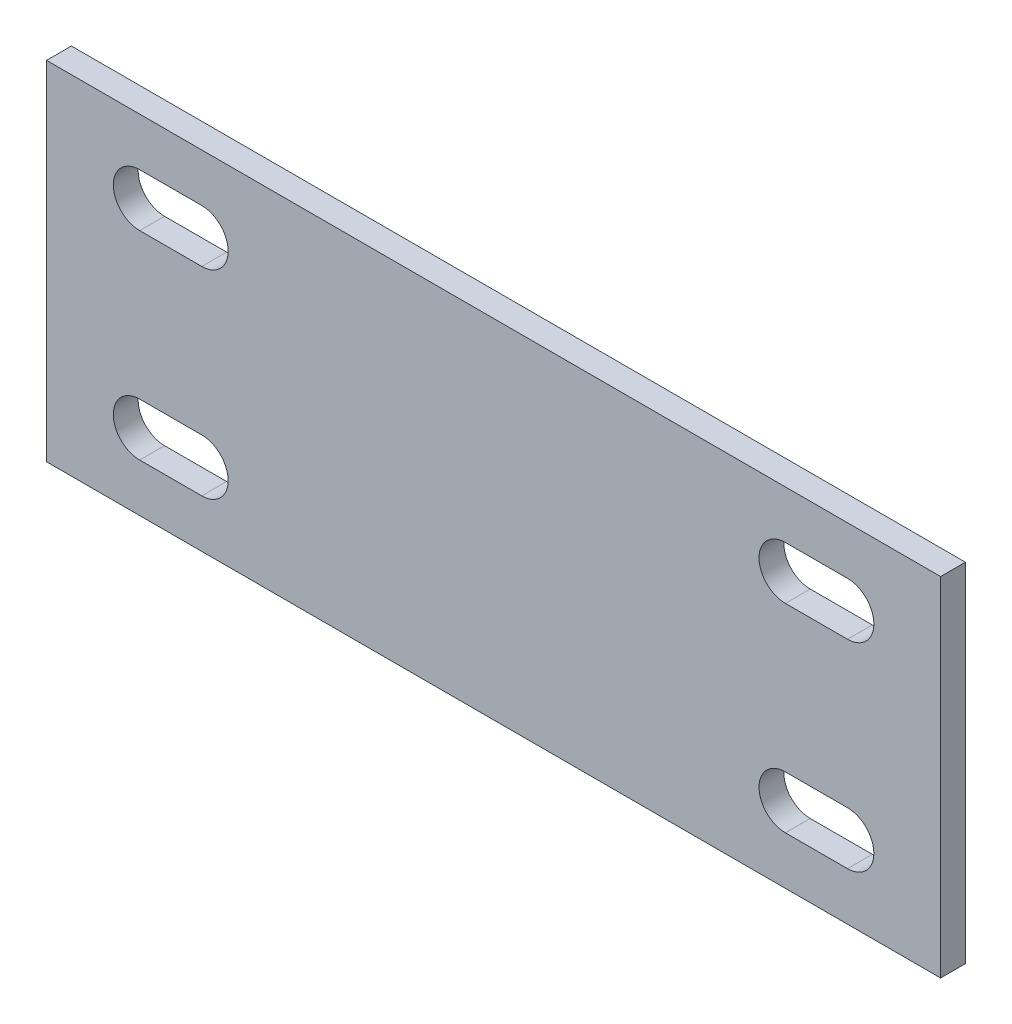
ISO-10303-21;
HEADER;
FILE_DESCRIPTION(('STEP AP214'),'2;1');
FILE_NAME('part.step','',(''),(''),'','','');
FILE_SCHEMA(('AUTOMOTIVE_DESIGN { 1 0 10303 214 1 1 1 1 }'));
ENDSEC;
DATA;
#1=APPLICATION_CONTEXT('core data for automotive mechanical design processes');
#2=APPLICATION_PROTOCOL_DEFINITION('international standard','automotive_design',2000,#1);
#3=PRODUCT_CONTEXT('',#1,'mechanical');
#4=PRODUCT('Part','Part','',(#3));
#5=PRODUCT_RELATED_PRODUCT_CATEGORY('part','',(#4));
#6=PRODUCT_DEFINITION_FORMATION('','',#4);
#7=PRODUCT_DEFINITION_CONTEXT('part definition',#1,'design');
#8=PRODUCT_DEFINITION('design','',#6,#7);
#9=PRODUCT_DEFINITION_SHAPE('','',#8);
#10=(LENGTH_UNIT() NAMED_UNIT(*) SI_UNIT(.MILLI.,.METRE.));
#11=(NAMED_UNIT(*) PLANE_ANGLE_UNIT() SI_UNIT($,.RADIAN.));
#12=(NAMED_UNIT(*) SI_UNIT($,.STERADIAN.) SOLID_ANGLE_UNIT());
#13=UNCERTAINTY_MEASURE_WITH_UNIT(LENGTH_MEASURE(1.E-05),#10,'distance_accuracy_value','');
#14=(GEOMETRIC_REPRESENTATION_CONTEXT(3) GLOBAL_UNCERTAINTY_ASSIGNED_CONTEXT((#13)) GLOBAL_UNIT_ASSIGNED_CONTEXT((#10,
#11,#12)) REPRESENTATION_CONTEXT('',''));
#15=CARTESIAN_POINT('',(0.,0.,0.));
#16=DIRECTION('',(0.,0.,1.));
#17=DIRECTION('',(1.,0.,0.));
#18=AXIS2_PLACEMENT_3D('',#15,#16,#17);
#19=CARTESIAN_POINT('',(0.,0.,6.35));
#20=DIRECTION('',(1.,0.,0.));
#21=DIRECTION('',(0.,1.,0.));
#22=AXIS2_PLACEMENT_3D('',#19,#20,#21);
#23=PLANE('',#22);
#24=DIRECTION('',(0.,-1.,0.));
#25=VECTOR('',#24,1.);
#26=CARTESIAN_POINT('',(0.,0.,0.));
#27=LINE('',#26,#25);
#28=CARTESIAN_POINT('',(0.,88.9,0.));
#29=VERTEX_POINT('',#28);
#30=CARTESIAN_POINT('',(0.,0.,0.));
#31=VERTEX_POINT('',#30);
#32=EDGE_CURVE('E297',#29,#31,#27,.T.);
#33=ORIENTED_EDGE('',*,*,#32,.T.);
#34=DIRECTION('',(0.,0.,-1.));
#35=VECTOR('',#34,1.);
#36=CARTESIAN_POINT('',(0.,0.,6.35));
#37=LINE('',#36,#35);
#38=CARTESIAN_POINT('',(0.,0.,6.35));
#39=VERTEX_POINT('',#38);
#40=EDGE_CURVE('E11',#39,#31,#37,.T.);
#41=ORIENTED_EDGE('',*,*,#40,.F.);
#42=DIRECTION('',(0.,-1.,0.));
#43=VECTOR('',#42,1.);
#44=CARTESIAN_POINT('',(0.,0.,6.35));
#45=LINE('',#44,#43);
#46=CARTESIAN_POINT('',(0.,88.9,6.35));
#47=VERTEX_POINT('',#46);
#48=EDGE_CURVE('E304',#47,#39,#45,.T.);
#49=ORIENTED_EDGE('',*,*,#48,.F.);
#50=DIRECTION('',(0.,0.,-1.));
#51=VECTOR('',#50,1.);
#52=CARTESIAN_POINT('',(0.,88.9,6.35));
#53=LINE('',#52,#51);
#54=EDGE_CURVE('E314',#47,#29,#53,.T.);
#55=ORIENTED_EDGE('',*,*,#54,.T.);
#56=EDGE_LOOP('',(#33,#41,#49,#55));
#57=FACE_BOUND('',#56,.T.);
#58=ADVANCED_FACE('F35',(#57),#23,.F.);
#59=CARTESIAN_POINT('',(0.,0.,6.35));
#60=DIRECTION('',(0.,1.,0.));
#61=DIRECTION('',(0.,0.,1.));
#62=AXIS2_PLACEMENT_3D('',#59,#60,#61);
#63=PLANE('',#62);
#64=DIRECTION('',(1.,0.,0.));
#65=VECTOR('',#64,1.);
#66=CARTESIAN_POINT('',(0.,0.,0.));
#67=LINE('',#66,#65);
#68=CARTESIAN_POINT('',(228.6,0.,0.));
#69=VERTEX_POINT('',#68);
#70=EDGE_CURVE('E317',#31,#69,#67,.T.);
#71=ORIENTED_EDGE('',*,*,#70,.T.);
#72=DIRECTION('',(0.,0.,-1.));
#73=VECTOR('',#72,1.);
#74=CARTESIAN_POINT('',(228.6,0.,6.35));
#75=LINE('',#74,#73);
#76=CARTESIAN_POINT('',(228.6,0.,6.35));
#77=VERTEX_POINT('',#76);
#78=EDGE_CURVE('E42',#77,#69,#75,.T.);
#79=ORIENTED_EDGE('',*,*,#78,.F.);
#80=DIRECTION('',(1.,0.,0.));
#81=VECTOR('',#80,1.);
#82=CARTESIAN_POINT('',(0.,0.,6.35));
#83=LINE('',#82,#81);
#84=EDGE_CURVE('E307',#39,#77,#83,.T.);
#85=ORIENTED_EDGE('',*,*,#84,.F.);
#86=ORIENTED_EDGE('',*,*,#40,.T.);
#87=EDGE_LOOP('',(#71,#79,#85,#86));
#88=FACE_BOUND('',#87,.T.);
#89=ADVANCED_FACE('F346',(#88),#63,.F.);
#90=CARTESIAN_POINT('',(228.6,0.,6.35));
#91=DIRECTION('',(-1.,0.,0.));
#92=DIRECTION('',(0.,0.,1.));
#93=AXIS2_PLACEMENT_3D('',#90,#91,#92);
#94=PLANE('',#93);
#95=DIRECTION('',(0.,1.,0.));
#96=VECTOR('',#95,1.);
#97=CARTESIAN_POINT('',(228.6,0.,0.));
#98=LINE('',#97,#96);
#99=CARTESIAN_POINT('',(228.6,88.9,0.));
#100=VERTEX_POINT('',#99);
#101=EDGE_CURVE('E319',#69,#100,#98,.T.);
#102=ORIENTED_EDGE('',*,*,#101,.T.);
#103=DIRECTION('',(0.,0.,-1.));
#104=VECTOR('',#103,1.);
#105=CARTESIAN_POINT('',(228.6,88.9,6.35));
#106=LINE('',#105,#104);
#107=CARTESIAN_POINT('',(228.6,88.9,6.35));
#108=VERTEX_POINT('',#107);
#109=EDGE_CURVE('E324',#108,#100,#106,.T.);
#110=ORIENTED_EDGE('',*,*,#109,.F.);
#111=DIRECTION('',(0.,1.,0.));
#112=VECTOR('',#111,1.);
#113=CARTESIAN_POINT('',(228.6,0.,6.35));
#114=LINE('',#113,#112);
#115=EDGE_CURVE('E310',#77,#108,#114,.T.);
#116=ORIENTED_EDGE('',*,*,#115,.F.);
#117=ORIENTED_EDGE('',*,*,#78,.T.);
#118=EDGE_LOOP('',(#102,#110,#116,#117));
#119=FACE_BOUND('',#118,.T.);
#120=ADVANCED_FACE('F331',(#119),#94,.F.);
#121=CARTESIAN_POINT('',(0.,88.9,6.35));
#122=DIRECTION('',(0.,-1.,0.));
#123=DIRECTION('',(0.,0.,-1.));
#124=AXIS2_PLACEMENT_3D('',#121,#122,#123);
#125=PLANE('',#124);
#126=DIRECTION('',(-1.,0.,0.));
#127=VECTOR('',#126,1.);
#128=CARTESIAN_POINT('',(0.,88.9,0.));
#129=LINE('',#128,#127);
#130=EDGE_CURVE('E308',#100,#29,#129,.T.);
#131=ORIENTED_EDGE('',*,*,#130,.T.);
#132=ORIENTED_EDGE('',*,*,#54,.F.);
#133=DIRECTION('',(-1.,0.,0.));
#134=VECTOR('',#133,1.);
#135=CARTESIAN_POINT('',(0.,88.9,6.35));
#136=LINE('',#135,#134);
#137=EDGE_CURVE('E312',#108,#47,#136,.T.);
#138=ORIENTED_EDGE('',*,*,#137,.F.);
#139=ORIENTED_EDGE('',*,*,#109,.T.);
#140=EDGE_LOOP('',(#131,#132,#138,#139));
#141=FACE_BOUND('',#140,.T.);
#142=ADVANCED_FACE('F339',(#141),#125,.F.);
#143=CARTESIAN_POINT('',(0.,88.9,6.35));
#144=DIRECTION('',(0.,0.,-1.));
#145=DIRECTION('',(-1.,0.,0.));
#146=AXIS2_PLACEMENT_3D('',#143,#144,#145);
#147=PLANE('',#146);
#148=DIRECTION('',(1.,0.,0.));
#149=VECTOR('',#148,1.);
#150=CARTESIAN_POINT('',(188.9125,12.3063,6.35));
#151=LINE('',#150,#149);
#152=CARTESIAN_POINT('',(188.9125,12.3063,6.35));
#153=VERTEX_POINT('',#152);
#154=CARTESIAN_POINT('',(204.7875,12.3063,6.35));
#155=VERTEX_POINT('',#154);
#156=EDGE_CURVE('E198',#153,#155,#151,.T.);
#157=ORIENTED_EDGE('',*,*,#156,.F.);
#158=CARTESIAN_POINT('',(188.9125,19.05,6.35));
#159=DIRECTION('',(0.,0.,1.));
#160=DIRECTION('',(1.,0.,0.));
#161=AXIS2_PLACEMENT_3D('',#158,#159,#160);
#162=CIRCLE('',#161,6.7437);
#163=CARTESIAN_POINT('',(188.9125,25.7937,6.35));
#164=VERTEX_POINT('',#163);
#165=EDGE_CURVE('E49',#164,#153,#162,.T.);
#166=ORIENTED_EDGE('',*,*,#165,.F.);
#167=DIRECTION('',(-1.,0.,0.));
#168=VECTOR('',#167,1.);
#169=CARTESIAN_POINT('',(188.9125,25.7937,6.35));
#170=LINE('',#169,#168);
#171=CARTESIAN_POINT('',(204.7875,25.7937,6.35));
#172=VERTEX_POINT('',#171);
#173=EDGE_CURVE('E189',#172,#164,#170,.T.);
#174=ORIENTED_EDGE('',*,*,#173,.F.);
#175=CARTESIAN_POINT('',(204.7875,19.05,6.35));
#176=DIRECTION('',(0.,0.,1.));
#177=DIRECTION('',(1.,0.,0.));
#178=AXIS2_PLACEMENT_3D('',#175,#176,#177);
#179=CIRCLE('',#178,6.7437);
#180=EDGE_CURVE('E192',#155,#172,#179,.T.);
#181=ORIENTED_EDGE('',*,*,#180,.F.);
#182=EDGE_LOOP('',(#157,#166,#174,#181));
#183=FACE_BOUND('',#182,.T.);
#184=DIRECTION('',(1.,0.,0.));
#185=VECTOR('',#184,1.);
#186=CARTESIAN_POINT('',(188.9125,63.1063,6.35));
#187=LINE('',#186,#185);
#188=CARTESIAN_POINT('',(188.9125,63.1063,6.35));
#189=VERTEX_POINT('',#188);
#190=CARTESIAN_POINT('',(204.7875,63.1063,6.35));
#191=VERTEX_POINT('',#190);
#192=EDGE_CURVE('E223',#189,#191,#187,.T.);
#193=ORIENTED_EDGE('',*,*,#192,.F.);
#194=CARTESIAN_POINT('',(188.9125,69.85,6.35));
#195=DIRECTION('',(0.,0.,1.));
#196=DIRECTION('',(1.,0.,0.));
#197=AXIS2_PLACEMENT_3D('',#194,#195,#196);
#198=CIRCLE('',#197,6.74369999999999);
#199=CARTESIAN_POINT('',(188.9125,76.5937,6.35));
#200=VERTEX_POINT('',#199);
#201=EDGE_CURVE('E204',#200,#189,#198,.T.);
#202=ORIENTED_EDGE('',*,*,#201,.F.);
#203=DIRECTION('',(-1.,0.,0.));
#204=VECTOR('',#203,1.);
#205=CARTESIAN_POINT('',(188.9125,76.5937,6.35));
#206=LINE('',#205,#204);
#207=CARTESIAN_POINT('',(204.7875,76.5937,6.35));
#208=VERTEX_POINT('',#207);
#209=EDGE_CURVE('E212',#208,#200,#206,.T.);
#210=ORIENTED_EDGE('',*,*,#209,.F.);
#211=CARTESIAN_POINT('',(204.7875,69.85,6.35));
#212=DIRECTION('',(0.,0.,1.));
#213=DIRECTION('',(1.,0.,0.));
#214=AXIS2_PLACEMENT_3D('',#211,#212,#213);
#215=CIRCLE('',#214,6.74369999999999);
#216=EDGE_CURVE('E226',#191,#208,#215,.T.);
#217=ORIENTED_EDGE('',*,*,#216,.F.);
#218=EDGE_LOOP('',(#193,#202,#210,#217));
#219=FACE_BOUND('',#218,.T.);
#220=DIRECTION('',(1.,0.,0.));
#221=VECTOR('',#220,1.);
#222=CARTESIAN_POINT('',(23.8125,12.3063,6.35));
#223=LINE('',#222,#221);
#224=CARTESIAN_POINT('',(23.8125,12.3063,6.35));
#225=VERTEX_POINT('',#224);
#226=CARTESIAN_POINT('',(39.6875,12.3063,6.35));
#227=VERTEX_POINT('',#226);
#228=EDGE_CURVE('E255',#225,#227,#223,.T.);
#229=ORIENTED_EDGE('',*,*,#228,.F.);
#230=CARTESIAN_POINT('',(23.8125,19.05,6.35));
#231=DIRECTION('',(0.,0.,1.));
#232=DIRECTION('',(1.,0.,0.));
#233=AXIS2_PLACEMENT_3D('',#230,#231,#232);
#234=CIRCLE('',#233,6.7437);
#235=CARTESIAN_POINT('',(23.8125,25.7937,6.35));
#236=VERTEX_POINT('',#235);
#237=EDGE_CURVE('E233',#236,#225,#234,.T.);
#238=ORIENTED_EDGE('',*,*,#237,.F.);
#239=DIRECTION('',(-1.,0.,0.));
#240=VECTOR('',#239,1.);
#241=CARTESIAN_POINT('',(23.8125,25.7937,6.35));
#242=LINE('',#241,#240);
#243=CARTESIAN_POINT('',(39.6875,25.7937,6.35));
#244=VERTEX_POINT('',#243);
#245=EDGE_CURVE('E244',#244,#236,#242,.T.);
#246=ORIENTED_EDGE('',*,*,#245,.F.);
#247=CARTESIAN_POINT('',(39.6875,19.05,6.35));
#248=DIRECTION('',(0.,0.,1.));
#249=DIRECTION('',(1.,0.,0.));
#250=AXIS2_PLACEMENT_3D('',#247,#248,#249);
#251=CIRCLE('',#250,6.7437);
#252=EDGE_CURVE('E258',#227,#244,#251,.T.);
#253=ORIENTED_EDGE('',*,*,#252,.F.);
#254=EDGE_LOOP('',(#229,#238,#246,#253));
#255=FACE_BOUND('',#254,.T.);
#256=DIRECTION('',(1.,0.,0.));
#257=VECTOR('',#256,1.);
#258=CARTESIAN_POINT('',(23.8125,63.1063,6.35));
#259=LINE('',#258,#257);
#260=CARTESIAN_POINT('',(23.8125,63.1063,6.35));
#261=VERTEX_POINT('',#260);
#262=CARTESIAN_POINT('',(39.6875,63.1063,6.35));
#263=VERTEX_POINT('',#262);
#264=EDGE_CURVE('E287',#261,#263,#259,.T.);
#265=ORIENTED_EDGE('',*,*,#264,.F.);
#266=CARTESIAN_POINT('',(23.8125,69.85,6.35));
#267=DIRECTION('',(0.,0.,1.));
#268=DIRECTION('',(1.,0.,0.));
#269=AXIS2_PLACEMENT_3D('',#266,#267,#268);
#270=CIRCLE('',#269,6.74369999999999);
#271=CARTESIAN_POINT('',(23.8125,76.5937,6.35));
#272=VERTEX_POINT('',#271);
#273=EDGE_CURVE('E265',#272,#261,#270,.T.);
#274=ORIENTED_EDGE('',*,*,#273,.F.);
#275=DIRECTION('',(-1.,0.,0.));
#276=VECTOR('',#275,1.);
#277=CARTESIAN_POINT('',(23.8125,76.5937,6.35));
#278=LINE('',#277,#276);
#279=CARTESIAN_POINT('',(39.6875,76.5937,6.35));
#280=VERTEX_POINT('',#279);
#281=EDGE_CURVE('E276',#280,#272,#278,.T.);
#282=ORIENTED_EDGE('',*,*,#281,.F.);
#283=CARTESIAN_POINT('',(39.6875,69.85,6.35));
#284=DIRECTION('',(0.,0.,1.));
#285=DIRECTION('',(1.,0.,0.));
#286=AXIS2_PLACEMENT_3D('',#283,#284,#285);
#287=CIRCLE('',#286,6.74369999999999);
#288=EDGE_CURVE('E290',#263,#280,#287,.T.);
#289=ORIENTED_EDGE('',*,*,#288,.F.);
#290=EDGE_LOOP('',(#265,#274,#282,#289));
#291=FACE_BOUND('',#290,.T.);
#292=ORIENTED_EDGE('',*,*,#48,.T.);
#293=ORIENTED_EDGE('',*,*,#84,.T.);
#294=ORIENTED_EDGE('',*,*,#115,.T.);
#295=ORIENTED_EDGE('',*,*,#137,.T.);
#296=EDGE_LOOP('',(#292,#293,#294,#295));
#297=FACE_BOUND('',#296,.T.);
#298=ADVANCED_FACE('F345',(#183,#219,#255,#291,#297),#147,.F.);
#299=CARTESIAN_POINT('',(0.,88.9,0.));
#300=DIRECTION('',(0.,0.,-1.));
#301=DIRECTION('',(-1.,0.,0.));
#302=AXIS2_PLACEMENT_3D('',#299,#300,#301);
#303=PLANE('',#302);
#304=CARTESIAN_POINT('',(188.9125,19.05,0.));
#305=DIRECTION('',(0.,0.,1.));
#306=DIRECTION('',(1.,0.,0.));
#307=AXIS2_PLACEMENT_3D('',#304,#305,#306);
#308=CIRCLE('',#307,6.7437);
#309=CARTESIAN_POINT('',(188.9125,25.7937,0.));
#310=VERTEX_POINT('',#309);
#311=CARTESIAN_POINT('',(188.9125,12.3063,0.));
#312=VERTEX_POINT('',#311);
#313=EDGE_CURVE('E173',#310,#312,#308,.T.);
#314=ORIENTED_EDGE('',*,*,#313,.T.);
#315=DIRECTION('',(1.,0.,0.));
#316=VECTOR('',#315,1.);
#317=CARTESIAN_POINT('',(188.9125,12.3063,0.));
#318=LINE('',#317,#316);
#319=CARTESIAN_POINT('',(204.7875,12.3063,0.));
#320=VERTEX_POINT('',#319);
#321=EDGE_CURVE('E182',#312,#320,#318,.T.);
#322=ORIENTED_EDGE('',*,*,#321,.T.);
#323=CARTESIAN_POINT('',(204.7875,19.05,0.));
#324=DIRECTION('',(0.,0.,1.));
#325=DIRECTION('',(1.,0.,0.));
#326=AXIS2_PLACEMENT_3D('',#323,#324,#325);
#327=CIRCLE('',#326,6.7437);
#328=CARTESIAN_POINT('',(204.7875,25.7937,0.));
#329=VERTEX_POINT('',#328);
#330=EDGE_CURVE('E57',#320,#329,#327,.T.);
#331=ORIENTED_EDGE('',*,*,#330,.T.);
#332=DIRECTION('',(-1.,0.,0.));
#333=VECTOR('',#332,1.);
#334=CARTESIAN_POINT('',(188.9125,25.7937,0.));
#335=LINE('',#334,#333);
#336=EDGE_CURVE('E179',#329,#310,#335,.T.);
#337=ORIENTED_EDGE('',*,*,#336,.T.);
#338=EDGE_LOOP('',(#314,#322,#331,#337));
#339=FACE_BOUND('',#338,.T.);
#340=CARTESIAN_POINT('',(188.9125,69.85,0.));
#341=DIRECTION('',(0.,0.,1.));
#342=DIRECTION('',(1.,0.,0.));
#343=AXIS2_PLACEMENT_3D('',#340,#341,#342);
#344=CIRCLE('',#343,6.74369999999999);
#345=CARTESIAN_POINT('',(188.9125,76.5937,0.));
#346=VERTEX_POINT('',#345);
#347=CARTESIAN_POINT('',(188.9125,63.1063,0.));
#348=VERTEX_POINT('',#347);
#349=EDGE_CURVE('E208',#346,#348,#344,.T.);
#350=ORIENTED_EDGE('',*,*,#349,.T.);
#351=DIRECTION('',(1.,0.,0.));
#352=VECTOR('',#351,1.);
#353=CARTESIAN_POINT('',(188.9125,63.1063,0.));
#354=LINE('',#353,#352);
#355=CARTESIAN_POINT('',(204.7875,63.1063,0.));
#356=VERTEX_POINT('',#355);
#357=EDGE_CURVE('E211',#348,#356,#354,.T.);
#358=ORIENTED_EDGE('',*,*,#357,.T.);
#359=CARTESIAN_POINT('',(204.7875,69.85,0.));
#360=DIRECTION('',(0.,0.,1.));
#361=DIRECTION('',(1.,0.,0.));
#362=AXIS2_PLACEMENT_3D('',#359,#360,#361);
#363=CIRCLE('',#362,6.74369999999999);
#364=CARTESIAN_POINT('',(204.7875,76.5937,0.));
#365=VERTEX_POINT('',#364);
#366=EDGE_CURVE('E215',#356,#365,#363,.T.);
#367=ORIENTED_EDGE('',*,*,#366,.T.);
#368=DIRECTION('',(-1.,0.,0.));
#369=VECTOR('',#368,1.);
#370=CARTESIAN_POINT('',(188.9125,76.5937,0.));
#371=LINE('',#370,#369);
#372=EDGE_CURVE('E218',#365,#346,#371,.T.);
#373=ORIENTED_EDGE('',*,*,#372,.T.);
#374=EDGE_LOOP('',(#350,#358,#367,#373));
#375=FACE_BOUND('',#374,.T.);
#376=CARTESIAN_POINT('',(23.8125,19.05,0.));
#377=DIRECTION('',(0.,0.,1.));
#378=DIRECTION('',(1.,0.,0.));
#379=AXIS2_PLACEMENT_3D('',#376,#377,#378);
#380=CIRCLE('',#379,6.7437);
#381=CARTESIAN_POINT('',(23.8125,25.7937,0.));
#382=VERTEX_POINT('',#381);
#383=CARTESIAN_POINT('',(23.8125,12.3063,0.));
#384=VERTEX_POINT('',#383);
#385=EDGE_CURVE('E240',#382,#384,#380,.T.);
#386=ORIENTED_EDGE('',*,*,#385,.T.);
#387=DIRECTION('',(1.,0.,0.));
#388=VECTOR('',#387,1.);
#389=CARTESIAN_POINT('',(23.8125,12.3063,0.));
#390=LINE('',#389,#388);
#391=CARTESIAN_POINT('',(39.6875,12.3063,0.));
#392=VERTEX_POINT('',#391);
#393=EDGE_CURVE('E243',#384,#392,#390,.T.);
#394=ORIENTED_EDGE('',*,*,#393,.T.);
#395=CARTESIAN_POINT('',(39.6875,19.05,0.));
#396=DIRECTION('',(0.,0.,1.));
#397=DIRECTION('',(1.,0.,0.));
#398=AXIS2_PLACEMENT_3D('',#395,#396,#397);
#399=CIRCLE('',#398,6.7437);
#400=CARTESIAN_POINT('',(39.6875,25.7937,0.));
#401=VERTEX_POINT('',#400);
#402=EDGE_CURVE('E247',#392,#401,#399,.T.);
#403=ORIENTED_EDGE('',*,*,#402,.T.);
#404=DIRECTION('',(-1.,0.,0.));
#405=VECTOR('',#404,1.);
#406=CARTESIAN_POINT('',(23.8125,25.7937,0.));
#407=LINE('',#406,#405);
#408=EDGE_CURVE('E250',#401,#382,#407,.T.);
#409=ORIENTED_EDGE('',*,*,#408,.T.);
#410=EDGE_LOOP('',(#386,#394,#403,#409));
#411=FACE_BOUND('',#410,.T.);
#412=CARTESIAN_POINT('',(23.8125,69.85,0.));
#413=DIRECTION('',(0.,0.,1.));
#414=DIRECTION('',(1.,0.,0.));
#415=AXIS2_PLACEMENT_3D('',#412,#413,#414);
#416=CIRCLE('',#415,6.74369999999999);
#417=CARTESIAN_POINT('',(23.8125,76.5937,0.));
#418=VERTEX_POINT('',#417);
#419=CARTESIAN_POINT('',(23.8125,63.1063,0.));
#420=VERTEX_POINT('',#419);
#421=EDGE_CURVE('E272',#418,#420,#416,.T.);
#422=ORIENTED_EDGE('',*,*,#421,.T.);
#423=DIRECTION('',(1.,0.,0.));
#424=VECTOR('',#423,1.);
#425=CARTESIAN_POINT('',(23.8125,63.1063,0.));
#426=LINE('',#425,#424);
#427=CARTESIAN_POINT('',(39.6875,63.1063,0.));
#428=VERTEX_POINT('',#427);
#429=EDGE_CURVE('E275',#420,#428,#426,.T.);
#430=ORIENTED_EDGE('',*,*,#429,.T.);
#431=CARTESIAN_POINT('',(39.6875,69.85,0.));
#432=DIRECTION('',(0.,0.,1.));
#433=DIRECTION('',(1.,0.,0.));
#434=AXIS2_PLACEMENT_3D('',#431,#432,#433);
#435=CIRCLE('',#434,6.74369999999999);
#436=CARTESIAN_POINT('',(39.6875,76.5937,0.));
#437=VERTEX_POINT('',#436);
#438=EDGE_CURVE('E279',#428,#437,#435,.T.);
#439=ORIENTED_EDGE('',*,*,#438,.T.);
#440=DIRECTION('',(-1.,0.,0.));
#441=VECTOR('',#440,1.);
#442=CARTESIAN_POINT('',(23.8125,76.5937,0.));
#443=LINE('',#442,#441);
#444=EDGE_CURVE('E282',#437,#418,#443,.T.);
#445=ORIENTED_EDGE('',*,*,#444,.T.);
#446=EDGE_LOOP('',(#422,#430,#439,#445));
#447=FACE_BOUND('',#446,.T.);
#448=ORIENTED_EDGE('',*,*,#32,.F.);
#449=ORIENTED_EDGE('',*,*,#130,.F.);
#450=ORIENTED_EDGE('',*,*,#101,.F.);
#451=ORIENTED_EDGE('',*,*,#70,.F.);
#452=EDGE_LOOP('',(#448,#449,#450,#451));
#453=FACE_BOUND('',#452,.T.);
#454=ADVANCED_FACE('F186',(#339,#375,#411,#447,#453),#303,.T.);
#455=CARTESIAN_POINT('',(23.8125,69.85,0.));
#456=DIRECTION('',(0.,0.,1.));
#457=DIRECTION('',(1.,0.,0.));
#458=AXIS2_PLACEMENT_3D('',#455,#456,#457);
#459=CYLINDRICAL_SURFACE('',#458,6.74369999999999);
#460=ORIENTED_EDGE('',*,*,#273,.T.);
#461=DIRECTION('',(0.,0.,1.));
#462=VECTOR('',#461,1.);
#463=CARTESIAN_POINT('',(23.8125,63.1063,0.));
#464=LINE('',#463,#462);
#465=EDGE_CURVE('E285',#420,#261,#464,.T.);
#466=ORIENTED_EDGE('',*,*,#465,.F.);
#467=ORIENTED_EDGE('',*,*,#421,.F.);
#468=DIRECTION('',(0.,0.,1.));
#469=VECTOR('',#468,1.);
#470=CARTESIAN_POINT('',(23.8125,76.5937,0.));
#471=LINE('',#470,#469);
#472=EDGE_CURVE('E295',#418,#272,#471,.T.);
#473=ORIENTED_EDGE('',*,*,#472,.T.);
#474=EDGE_LOOP('',(#460,#466,#467,#473));
#475=FACE_BOUND('',#474,.T.);
#476=ADVANCED_FACE('F358',(#475),#459,.F.);
#477=CARTESIAN_POINT('',(23.8125,76.5937,0.));
#478=DIRECTION('',(0.,1.,0.));
#479=DIRECTION('',(0.,0.,1.));
#480=AXIS2_PLACEMENT_3D('',#477,#478,#479);
#481=PLANE('',#480);
#482=ORIENTED_EDGE('',*,*,#281,.T.);
#483=ORIENTED_EDGE('',*,*,#472,.F.);
#484=ORIENTED_EDGE('',*,*,#444,.F.);
#485=DIRECTION('',(0.,0.,1.));
#486=VECTOR('',#485,1.);
#487=CARTESIAN_POINT('',(39.6875,76.5937,0.));
#488=LINE('',#487,#486);
#489=EDGE_CURVE('E298',#437,#280,#488,.T.);
#490=ORIENTED_EDGE('',*,*,#489,.T.);
#491=EDGE_LOOP('',(#482,#483,#484,#490));
#492=FACE_BOUND('',#491,.T.);
#493=ADVANCED_FACE('F364',(#492),#481,.F.);
#494=CARTESIAN_POINT('',(39.6875,69.85,0.));
#495=DIRECTION('',(0.,0.,1.));
#496=DIRECTION('',(1.,0.,0.));
#497=AXIS2_PLACEMENT_3D('',#494,#495,#496);
#498=CYLINDRICAL_SURFACE('',#497,6.74369999999999);
#499=ORIENTED_EDGE('',*,*,#288,.T.);
#500=ORIENTED_EDGE('',*,*,#489,.F.);
#501=ORIENTED_EDGE('',*,*,#438,.F.);
#502=DIRECTION('',(0.,0.,1.));
#503=VECTOR('',#502,1.);
#504=CARTESIAN_POINT('',(39.6875,63.1063,0.));
#505=LINE('',#504,#503);
#506=EDGE_CURVE('E300',#428,#263,#505,.T.);
#507=ORIENTED_EDGE('',*,*,#506,.T.);
#508=EDGE_LOOP('',(#499,#500,#501,#507));
#509=FACE_BOUND('',#508,.T.);
#510=ADVANCED_FACE('F370',(#509),#498,.F.);
#511=CARTESIAN_POINT('',(23.8125,63.1063,0.));
#512=DIRECTION('',(0.,-1.,0.));
#513=DIRECTION('',(0.,0.,-1.));
#514=AXIS2_PLACEMENT_3D('',#511,#512,#513);
#515=PLANE('',#514);
#516=ORIENTED_EDGE('',*,*,#264,.T.);
#517=ORIENTED_EDGE('',*,*,#506,.F.);
#518=ORIENTED_EDGE('',*,*,#429,.F.);
#519=ORIENTED_EDGE('',*,*,#465,.T.);
#520=EDGE_LOOP('',(#516,#517,#518,#519));
#521=FACE_BOUND('',#520,.T.);
#522=ADVANCED_FACE('F366',(#521),#515,.F.);
#523=CARTESIAN_POINT('',(23.8125,19.05,0.));
#524=DIRECTION('',(0.,0.,1.));
#525=DIRECTION('',(1.,0.,0.));
#526=AXIS2_PLACEMENT_3D('',#523,#524,#525);
#527=CYLINDRICAL_SURFACE('',#526,6.7437);
#528=ORIENTED_EDGE('',*,*,#237,.T.);
#529=DIRECTION('',(0.,0.,1.));
#530=VECTOR('',#529,1.);
#531=CARTESIAN_POINT('',(23.8125,12.3063,0.));
#532=LINE('',#531,#530);
#533=EDGE_CURVE('E253',#384,#225,#532,.T.);
#534=ORIENTED_EDGE('',*,*,#533,.F.);
#535=ORIENTED_EDGE('',*,*,#385,.F.);
#536=DIRECTION('',(0.,0.,1.));
#537=VECTOR('',#536,1.);
#538=CARTESIAN_POINT('',(23.8125,25.7937,0.));
#539=LINE('',#538,#537);
#540=EDGE_CURVE('E263',#382,#236,#539,.T.);
#541=ORIENTED_EDGE('',*,*,#540,.T.);
#542=EDGE_LOOP('',(#528,#534,#535,#541));
#543=FACE_BOUND('',#542,.T.);
#544=ADVANCED_FACE('F369',(#543),#527,.F.);
#545=CARTESIAN_POINT('',(23.8125,25.7937,0.));
#546=DIRECTION('',(0.,1.,0.));
#547=DIRECTION('',(-1.,0.,0.));
#548=AXIS2_PLACEMENT_3D('',#545,#546,#547);
#549=PLANE('',#548);
#550=ORIENTED_EDGE('',*,*,#245,.T.);
#551=ORIENTED_EDGE('',*,*,#540,.F.);
#552=ORIENTED_EDGE('',*,*,#408,.F.);
#553=DIRECTION('',(0.,0.,1.));
#554=VECTOR('',#553,1.);
#555=CARTESIAN_POINT('',(39.6875,25.7937,0.));
#556=LINE('',#555,#554);
#557=EDGE_CURVE('E266',#401,#244,#556,.T.);
#558=ORIENTED_EDGE('',*,*,#557,.T.);
#559=EDGE_LOOP('',(#550,#551,#552,#558));
#560=FACE_BOUND('',#559,.T.);
#561=ADVANCED_FACE('F380',(#560),#549,.F.);
#562=CARTESIAN_POINT('',(39.6875,19.05,0.));
#563=DIRECTION('',(0.,0.,1.));
#564=DIRECTION('',(1.,0.,0.));
#565=AXIS2_PLACEMENT_3D('',#562,#563,#564);
#566=CYLINDRICAL_SURFACE('',#565,6.7437);
#567=ORIENTED_EDGE('',*,*,#252,.T.);
#568=ORIENTED_EDGE('',*,*,#557,.F.);
#569=ORIENTED_EDGE('',*,*,#402,.F.);
#570=DIRECTION('',(0.,0.,1.));
#571=VECTOR('',#570,1.);
#572=CARTESIAN_POINT('',(39.6875,12.3063,0.));
#573=LINE('',#572,#571);
#574=EDGE_CURVE('E268',#392,#227,#573,.T.);
#575=ORIENTED_EDGE('',*,*,#574,.T.);
#576=EDGE_LOOP('',(#567,#568,#569,#575));
#577=FACE_BOUND('',#576,.T.);
#578=ADVANCED_FACE('F386',(#577),#566,.F.);
#579=CARTESIAN_POINT('',(23.8125,12.3063,0.));
#580=DIRECTION('',(0.,-1.,0.));
#581=DIRECTION('',(1.,0.,0.));
#582=AXIS2_PLACEMENT_3D('',#579,#580,#581);
#583=PLANE('',#582);
#584=ORIENTED_EDGE('',*,*,#228,.T.);
#585=ORIENTED_EDGE('',*,*,#574,.F.);
#586=ORIENTED_EDGE('',*,*,#393,.F.);
#587=ORIENTED_EDGE('',*,*,#533,.T.);
#588=EDGE_LOOP('',(#584,#585,#586,#587));
#589=FACE_BOUND('',#588,.T.);
#590=ADVANCED_FACE('F382',(#589),#583,.F.);
#591=CARTESIAN_POINT('',(188.9125,69.85,0.));
#592=DIRECTION('',(0.,0.,1.));
#593=DIRECTION('',(1.,0.,0.));
#594=AXIS2_PLACEMENT_3D('',#591,#592,#593);
#595=CYLINDRICAL_SURFACE('',#594,6.74369999999999);
#596=ORIENTED_EDGE('',*,*,#201,.T.);
#597=DIRECTION('',(0.,0.,1.));
#598=VECTOR('',#597,1.);
#599=CARTESIAN_POINT('',(188.9125,63.1063,0.));
#600=LINE('',#599,#598);
#601=EDGE_CURVE('E221',#348,#189,#600,.T.);
#602=ORIENTED_EDGE('',*,*,#601,.F.);
#603=ORIENTED_EDGE('',*,*,#349,.F.);
#604=DIRECTION('',(0.,0.,1.));
#605=VECTOR('',#604,1.);
#606=CARTESIAN_POINT('',(188.9125,76.5937,0.));
#607=LINE('',#606,#605);
#608=EDGE_CURVE('E231',#346,#200,#607,.T.);
#609=ORIENTED_EDGE('',*,*,#608,.T.);
#610=EDGE_LOOP('',(#596,#602,#603,#609));
#611=FACE_BOUND('',#610,.T.);
#612=ADVANCED_FACE('F385',(#611),#595,.F.);
#613=CARTESIAN_POINT('',(188.9125,76.5937,0.));
#614=DIRECTION('',(0.,1.,0.));
#615=DIRECTION('',(0.,0.,1.));
#616=AXIS2_PLACEMENT_3D('',#613,#614,#615);
#617=PLANE('',#616);
#618=ORIENTED_EDGE('',*,*,#209,.T.);
#619=ORIENTED_EDGE('',*,*,#608,.F.);
#620=ORIENTED_EDGE('',*,*,#372,.F.);
#621=DIRECTION('',(0.,0.,1.));
#622=VECTOR('',#621,1.);
#623=CARTESIAN_POINT('',(204.7875,76.5937,0.));
#624=LINE('',#623,#622);
#625=EDGE_CURVE('E234',#365,#208,#624,.T.);
#626=ORIENTED_EDGE('',*,*,#625,.T.);
#627=EDGE_LOOP('',(#618,#619,#620,#626));
#628=FACE_BOUND('',#627,.T.);
#629=ADVANCED_FACE('F396',(#628),#617,.F.);
#630=CARTESIAN_POINT('',(204.7875,69.85,0.));
#631=DIRECTION('',(0.,0.,1.));
#632=DIRECTION('',(1.,0.,0.));
#633=AXIS2_PLACEMENT_3D('',#630,#631,#632);
#634=CYLINDRICAL_SURFACE('',#633,6.74369999999999);
#635=ORIENTED_EDGE('',*,*,#216,.T.);
#636=ORIENTED_EDGE('',*,*,#625,.F.);
#637=ORIENTED_EDGE('',*,*,#366,.F.);
#638=DIRECTION('',(0.,0.,1.));
#639=VECTOR('',#638,1.);
#640=CARTESIAN_POINT('',(204.7875,63.1063,0.));
#641=LINE('',#640,#639);
#642=EDGE_CURVE('E236',#356,#191,#641,.T.);
#643=ORIENTED_EDGE('',*,*,#642,.T.);
#644=EDGE_LOOP('',(#635,#636,#637,#643));
#645=FACE_BOUND('',#644,.T.);
#646=ADVANCED_FACE('F401',(#645),#634,.F.);
#647=CARTESIAN_POINT('',(188.9125,63.1063,0.));
#648=DIRECTION('',(0.,-1.,0.));
#649=DIRECTION('',(0.,0.,-1.));
#650=AXIS2_PLACEMENT_3D('',#647,#648,#649);
#651=PLANE('',#650);
#652=ORIENTED_EDGE('',*,*,#192,.T.);
#653=ORIENTED_EDGE('',*,*,#642,.F.);
#654=ORIENTED_EDGE('',*,*,#357,.F.);
#655=ORIENTED_EDGE('',*,*,#601,.T.);
#656=EDGE_LOOP('',(#652,#653,#654,#655));
#657=FACE_BOUND('',#656,.T.);
#658=ADVANCED_FACE('F398',(#657),#651,.F.);
#659=CARTESIAN_POINT('',(188.9125,19.05,0.));
#660=DIRECTION('',(0.,0.,1.));
#661=DIRECTION('',(1.,0.,0.));
#662=AXIS2_PLACEMENT_3D('',#659,#660,#661);
#663=CYLINDRICAL_SURFACE('',#662,6.7437);
#664=ORIENTED_EDGE('',*,*,#165,.T.);
#665=DIRECTION('',(0.,0.,1.));
#666=VECTOR('',#665,1.);
#667=CARTESIAN_POINT('',(188.9125,12.3063,0.));
#668=LINE('',#667,#666);
#669=EDGE_CURVE('E169',#312,#153,#668,.T.);
#670=ORIENTED_EDGE('',*,*,#669,.F.);
#671=ORIENTED_EDGE('',*,*,#313,.F.);
#672=DIRECTION('',(0.,0.,1.));
#673=VECTOR('',#672,1.);
#674=CARTESIAN_POINT('',(188.9125,25.7937,0.));
#675=LINE('',#674,#673);
#676=EDGE_CURVE('E202',#310,#164,#675,.T.);
#677=ORIENTED_EDGE('',*,*,#676,.T.);
#678=EDGE_LOOP('',(#664,#670,#671,#677));
#679=FACE_BOUND('',#678,.T.);
#680=ADVANCED_FACE('F171',(#679),#663,.F.);
#681=CARTESIAN_POINT('',(188.9125,25.7937,0.));
#682=DIRECTION('',(0.,1.,0.));
#683=DIRECTION('',(-1.,0.,0.));
#684=AXIS2_PLACEMENT_3D('',#681,#682,#683);
#685=PLANE('',#684);
#686=ORIENTED_EDGE('',*,*,#173,.T.);
#687=ORIENTED_EDGE('',*,*,#676,.F.);
#688=ORIENTED_EDGE('',*,*,#336,.F.);
#689=DIRECTION('',(0.,0.,1.));
#690=VECTOR('',#689,1.);
#691=CARTESIAN_POINT('',(204.7875,25.7937,0.));
#692=LINE('',#691,#690);
#693=EDGE_CURVE('E205',#329,#172,#692,.T.);
#694=ORIENTED_EDGE('',*,*,#693,.T.);
#695=EDGE_LOOP('',(#686,#687,#688,#694));
#696=FACE_BOUND('',#695,.T.);
#697=ADVANCED_FACE('F411',(#696),#685,.F.);
#698=CARTESIAN_POINT('',(204.7875,19.05,0.));
#699=DIRECTION('',(0.,0.,1.));
#700=DIRECTION('',(1.,0.,0.));
#701=AXIS2_PLACEMENT_3D('',#698,#699,#700);
#702=CYLINDRICAL_SURFACE('',#701,6.7437);
#703=ORIENTED_EDGE('',*,*,#180,.T.);
#704=ORIENTED_EDGE('',*,*,#693,.F.);
#705=ORIENTED_EDGE('',*,*,#330,.F.);
#706=DIRECTION('',(0.,0.,1.));
#707=VECTOR('',#706,1.);
#708=CARTESIAN_POINT('',(204.7875,12.3063,0.));
#709=LINE('',#708,#707);
#710=EDGE_CURVE('E178',#320,#155,#709,.T.);
#711=ORIENTED_EDGE('',*,*,#710,.T.);
#712=EDGE_LOOP('',(#703,#704,#705,#711));
#713=FACE_BOUND('',#712,.T.);
#714=ADVANCED_FACE('F414',(#713),#702,.F.);
#715=CARTESIAN_POINT('',(188.9125,12.3063,0.));
#716=DIRECTION('',(0.,-1.,0.));
#717=DIRECTION('',(1.,0.,0.));
#718=AXIS2_PLACEMENT_3D('',#715,#716,#717);
#719=PLANE('',#718);
#720=ORIENTED_EDGE('',*,*,#156,.T.);
#721=ORIENTED_EDGE('',*,*,#710,.F.);
#722=ORIENTED_EDGE('',*,*,#321,.F.);
#723=ORIENTED_EDGE('',*,*,#669,.T.);
#724=EDGE_LOOP('',(#720,#721,#722,#723));
#725=FACE_BOUND('',#724,.T.);
#726=ADVANCED_FACE('F183',(#725),#719,.F.);
#727=CLOSED_SHELL('',(#58,#89,#120,#142,#298,#454,#476,#493,#510,#522,#544,#561,#578,#590,#612,
#629,#646,#658,#680,#697,#714,#726));
#728=MANIFOLD_SOLID_BREP('B2',#727);
#729=ADVANCED_BREP_SHAPE_REPRESENTATION('',(#18,#728),#14);
#730=SHAPE_DEFINITION_REPRESENTATION(#9,#729);
ENDSEC;
END-ISO-10303-21;
